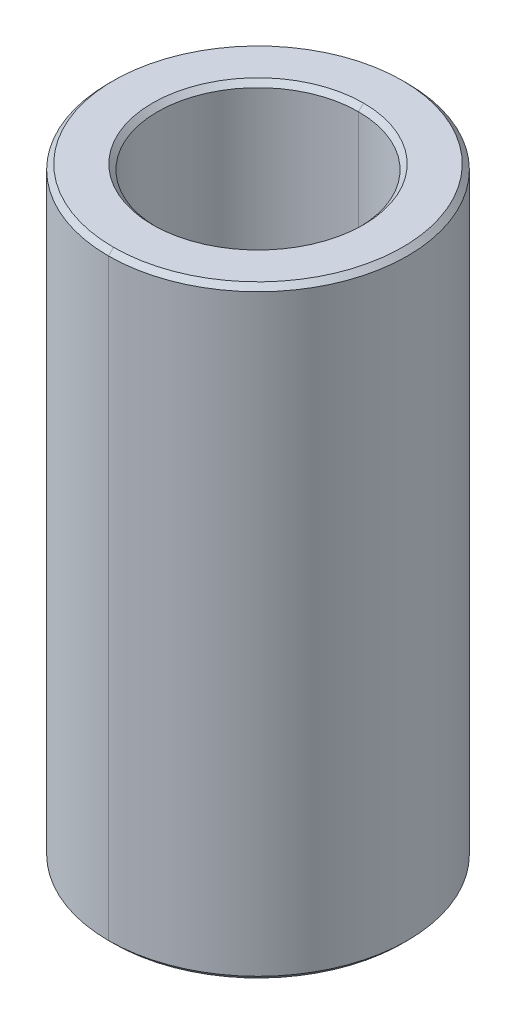
ISO-10303-21;
HEADER;
FILE_DESCRIPTION(('STEP AP214'),'2;1');
FILE_NAME('part.step','',(''),(''),'','','');
FILE_SCHEMA(('AUTOMOTIVE_DESIGN { 1 0 10303 214 1 1 1 1 }'));
ENDSEC;
DATA;
#1=APPLICATION_CONTEXT('core data for automotive mechanical design processes');
#2=APPLICATION_PROTOCOL_DEFINITION('international standard','automotive_design',2000,#1);
#3=PRODUCT_CONTEXT('',#1,'mechanical');
#4=PRODUCT('Part','Part','',(#3));
#5=PRODUCT_RELATED_PRODUCT_CATEGORY('part','',(#4));
#6=PRODUCT_DEFINITION_FORMATION('','',#4);
#7=PRODUCT_DEFINITION_CONTEXT('part definition',#1,'design');
#8=PRODUCT_DEFINITION('design','',#6,#7);
#9=PRODUCT_DEFINITION_SHAPE('','',#8);
#10=(LENGTH_UNIT() NAMED_UNIT(*) SI_UNIT(.MILLI.,.METRE.));
#11=(NAMED_UNIT(*) PLANE_ANGLE_UNIT() SI_UNIT($,.RADIAN.));
#12=(NAMED_UNIT(*) SI_UNIT($,.STERADIAN.) SOLID_ANGLE_UNIT());
#13=UNCERTAINTY_MEASURE_WITH_UNIT(LENGTH_MEASURE(1.E-05),#10,'distance_accuracy_value','');
#14=(GEOMETRIC_REPRESENTATION_CONTEXT(3) GLOBAL_UNCERTAINTY_ASSIGNED_CONTEXT((#13)) GLOBAL_UNIT_ASSIGNED_CONTEXT((#10,
#11,#12)) REPRESENTATION_CONTEXT('',''));
#15=CARTESIAN_POINT('',(0.,0.,0.));
#16=DIRECTION('',(0.,0.,1.));
#17=DIRECTION('',(1.,0.,0.));
#18=AXIS2_PLACEMENT_3D('',#15,#16,#17);
#19=CARTESIAN_POINT('',(0.,5.9,0.));
#20=DIRECTION('',(0.,1.,0.));
#21=DIRECTION('',(0.,0.,1.));
#22=AXIS2_PLACEMENT_3D('',#19,#20,#21);
#23=CONICAL_SURFACE('',#22,2.,0.785398163397457);
#24=DIRECTION('',(0.,0.707106781186542,-0.707106781186554));
#25=VECTOR('',#24,1.);
#26=CARTESIAN_POINT('',(0.,5.9,-2.));
#27=LINE('',#26,#25);
#28=CARTESIAN_POINT('',(0.,5.9,-2.));
#29=VERTEX_POINT('',#28);
#30=CARTESIAN_POINT('',(0.,6.,-2.1));
#31=VERTEX_POINT('',#30);
#32=EDGE_CURVE('E130',#29,#31,#27,.T.);
#33=ORIENTED_EDGE('',*,*,#32,.F.);
#34=CARTESIAN_POINT('',(0.,5.9,0.));
#35=DIRECTION('',(0.,1.,0.));
#36=DIRECTION('',(0.,0.,1.));
#37=AXIS2_PLACEMENT_3D('',#34,#35,#36);
#38=CIRCLE('',#37,2.);
#39=CARTESIAN_POINT('',(0.,5.9,2.));
#40=VERTEX_POINT('',#39);
#41=EDGE_CURVE('E25',#40,#29,#38,.T.);
#42=ORIENTED_EDGE('',*,*,#41,.F.);
#43=DIRECTION('',(0.,0.707106781186542,0.707106781186554));
#44=VECTOR('',#43,1.);
#45=CARTESIAN_POINT('',(0.,5.9,2.));
#46=LINE('',#45,#44);
#47=CARTESIAN_POINT('',(0.,6.,2.1));
#48=VERTEX_POINT('',#47);
#49=EDGE_CURVE('E139',#40,#48,#46,.T.);
#50=ORIENTED_EDGE('',*,*,#49,.T.);
#51=CARTESIAN_POINT('',(0.,6.,0.));
#52=DIRECTION('',(0.,-1.,0.));
#53=DIRECTION('',(0.,0.,1.));
#54=AXIS2_PLACEMENT_3D('',#51,#52,#53);
#55=CIRCLE('',#54,2.1);
#56=EDGE_CURVE('E131',#31,#48,#55,.T.);
#57=ORIENTED_EDGE('',*,*,#56,.F.);
#58=EDGE_LOOP('',(#33,#42,#50,#57));
#59=FACE_BOUND('',#58,.T.);
#60=ADVANCED_FACE('F14',(#59),#23,.F.);
#61=CARTESIAN_POINT('',(0.,-6.,0.));
#62=DIRECTION('',(0.,-1.,0.));
#63=DIRECTION('',(0.,0.,-1.));
#64=AXIS2_PLACEMENT_3D('',#61,#62,#63);
#65=CONICAL_SURFACE('',#64,2.1,0.785398163397448);
#66=DIRECTION('',(0.,-0.707106781186548,0.707106781186548));
#67=VECTOR('',#66,1.);
#68=CARTESIAN_POINT('',(0.,-6.,2.1));
#69=LINE('',#68,#67);
#70=CARTESIAN_POINT('',(0.,-5.9,2.));
#71=VERTEX_POINT('',#70);
#72=CARTESIAN_POINT('',(0.,-6.,2.1));
#73=VERTEX_POINT('',#72);
#74=EDGE_CURVE('E177',#71,#73,#69,.T.);
#75=ORIENTED_EDGE('',*,*,#74,.F.);
#76=CARTESIAN_POINT('',(0.,-5.9,0.));
#77=DIRECTION('',(0.,-1.,0.));
#78=DIRECTION('',(0.,0.,1.));
#79=AXIS2_PLACEMENT_3D('',#76,#77,#78);
#80=CIRCLE('',#79,2.);
#81=CARTESIAN_POINT('',(0.,-5.9,-2.));
#82=VERTEX_POINT('',#81);
#83=EDGE_CURVE('E9',#82,#71,#80,.T.);
#84=ORIENTED_EDGE('',*,*,#83,.F.);
#85=DIRECTION('',(0.,-0.707106781186548,-0.707106781186548));
#86=VECTOR('',#85,1.);
#87=CARTESIAN_POINT('',(0.,-6.,-2.1));
#88=LINE('',#87,#86);
#89=CARTESIAN_POINT('',(0.,-6.,-2.1));
#90=VERTEX_POINT('',#89);
#91=EDGE_CURVE('E212',#82,#90,#88,.T.);
#92=ORIENTED_EDGE('',*,*,#91,.T.);
#93=CARTESIAN_POINT('',(0.,-6.,0.));
#94=DIRECTION('',(0.,1.,0.));
#95=DIRECTION('',(0.,0.,1.));
#96=AXIS2_PLACEMENT_3D('',#93,#94,#95);
#97=CIRCLE('',#96,2.1);
#98=EDGE_CURVE('E69',#73,#90,#97,.T.);
#99=ORIENTED_EDGE('',*,*,#98,.F.);
#100=EDGE_LOOP('',(#75,#84,#92,#99));
#101=FACE_BOUND('',#100,.T.);
#102=ADVANCED_FACE('F253',(#101),#65,.F.);
#103=CARTESIAN_POINT('',(0.,6.,0.));
#104=DIRECTION('',(0.,-1.,0.));
#105=DIRECTION('',(0.,0.,-1.));
#106=AXIS2_PLACEMENT_3D('',#103,#104,#105);
#107=CONICAL_SURFACE('',#106,2.875,0.785398163397443);
#108=DIRECTION('',(0.,-0.707106781186551,0.707106781186545));
#109=VECTOR('',#108,1.);
#110=CARTESIAN_POINT('',(0.,6.,2.875));
#111=LINE('',#110,#109);
#112=CARTESIAN_POINT('',(0.,6.,2.875));
#113=VERTEX_POINT('',#112);
#114=CARTESIAN_POINT('',(0.,5.9,2.975));
#115=VERTEX_POINT('',#114);
#116=EDGE_CURVE('E178',#113,#115,#111,.T.);
#117=ORIENTED_EDGE('',*,*,#116,.F.);
#118=CARTESIAN_POINT('',(0.,6.,0.));
#119=DIRECTION('',(0.,1.,0.));
#120=DIRECTION('',(0.,0.,1.));
#121=AXIS2_PLACEMENT_3D('',#118,#119,#120);
#122=CIRCLE('',#121,2.875);
#123=CARTESIAN_POINT('',(0.,6.,-2.875));
#124=VERTEX_POINT('',#123);
#125=EDGE_CURVE('E164',#124,#113,#122,.T.);
#126=ORIENTED_EDGE('',*,*,#125,.F.);
#127=DIRECTION('',(0.,-0.707106781186551,-0.707106781186545));
#128=VECTOR('',#127,1.);
#129=CARTESIAN_POINT('',(0.,6.,-2.875));
#130=LINE('',#129,#128);
#131=CARTESIAN_POINT('',(0.,5.9,-2.975));
#132=VERTEX_POINT('',#131);
#133=EDGE_CURVE('E159',#124,#132,#130,.T.);
#134=ORIENTED_EDGE('',*,*,#133,.T.);
#135=CARTESIAN_POINT('',(0.,5.9,0.));
#136=DIRECTION('',(0.,-1.,0.));
#137=DIRECTION('',(0.,0.,1.));
#138=AXIS2_PLACEMENT_3D('',#135,#136,#137);
#139=CIRCLE('',#138,2.975);
#140=EDGE_CURVE('E151',#115,#132,#139,.T.);
#141=ORIENTED_EDGE('',*,*,#140,.F.);
#142=EDGE_LOOP('',(#117,#126,#134,#141));
#143=FACE_BOUND('',#142,.T.);
#144=ADVANCED_FACE('F236',(#143),#107,.T.);
#145=CARTESIAN_POINT('',(0.,-5.9,0.));
#146=DIRECTION('',(0.,1.,0.));
#147=DIRECTION('',(0.,0.,1.));
#148=AXIS2_PLACEMENT_3D('',#145,#146,#147);
#149=CONICAL_SURFACE('',#148,2.975,0.785398163397443);
#150=DIRECTION('',(0.,0.707106781186551,-0.707106781186545));
#151=VECTOR('',#150,1.);
#152=CARTESIAN_POINT('',(0.,-5.9,-2.975));
#153=LINE('',#152,#151);
#154=CARTESIAN_POINT('',(0.,-6.,-2.875));
#155=VERTEX_POINT('',#154);
#156=CARTESIAN_POINT('',(0.,-5.9,-2.975));
#157=VERTEX_POINT('',#156);
#158=EDGE_CURVE('E158',#155,#157,#153,.T.);
#159=ORIENTED_EDGE('',*,*,#158,.F.);
#160=CARTESIAN_POINT('',(0.,-6.,0.));
#161=DIRECTION('',(0.,-1.,0.));
#162=DIRECTION('',(0.,0.,1.));
#163=AXIS2_PLACEMENT_3D('',#160,#161,#162);
#164=CIRCLE('',#163,2.875);
#165=CARTESIAN_POINT('',(0.,-6.,2.875));
#166=VERTEX_POINT('',#165);
#167=EDGE_CURVE('E184',#166,#155,#164,.T.);
#168=ORIENTED_EDGE('',*,*,#167,.F.);
#169=DIRECTION('',(0.,0.707106781186551,0.707106781186545));
#170=VECTOR('',#169,1.);
#171=CARTESIAN_POINT('',(0.,-5.9,2.975));
#172=LINE('',#171,#170);
#173=CARTESIAN_POINT('',(0.,-5.9,2.975));
#174=VERTEX_POINT('',#173);
#175=EDGE_CURVE('E192',#166,#174,#172,.T.);
#176=ORIENTED_EDGE('',*,*,#175,.T.);
#177=CARTESIAN_POINT('',(0.,-5.9,0.));
#178=DIRECTION('',(0.,1.,0.));
#179=DIRECTION('',(0.,0.,1.));
#180=AXIS2_PLACEMENT_3D('',#177,#178,#179);
#181=CIRCLE('',#180,2.975);
#182=EDGE_CURVE('E40',#157,#174,#181,.T.);
#183=ORIENTED_EDGE('',*,*,#182,.F.);
#184=EDGE_LOOP('',(#159,#168,#176,#183));
#185=FACE_BOUND('',#184,.T.);
#186=ADVANCED_FACE('F270',(#185),#149,.T.);
#187=CARTESIAN_POINT('',(0.,6.,0.));
#188=DIRECTION('',(0.,-1.,0.));
#189=DIRECTION('',(0.,0.,-1.));
#190=AXIS2_PLACEMENT_3D('',#187,#188,#189);
#191=CYLINDRICAL_SURFACE('',#190,2.);
#192=DIRECTION('',(0.,-1.,0.));
#193=VECTOR('',#192,1.);
#194=CARTESIAN_POINT('',(0.,6.,2.));
#195=LINE('',#194,#193);
#196=EDGE_CURVE('E112',#40,#71,#195,.T.);
#197=ORIENTED_EDGE('',*,*,#196,.F.);
#198=ORIENTED_EDGE('',*,*,#41,.T.);
#199=DIRECTION('',(0.,-1.,0.));
#200=VECTOR('',#199,1.);
#201=CARTESIAN_POINT('',(0.,6.,-2.));
#202=LINE('',#201,#200);
#203=EDGE_CURVE('E109',#29,#82,#202,.T.);
#204=ORIENTED_EDGE('',*,*,#203,.T.);
#205=ORIENTED_EDGE('',*,*,#83,.T.);
#206=EDGE_LOOP('',(#197,#198,#204,#205));
#207=FACE_BOUND('',#206,.T.);
#208=ADVANCED_FACE('F108',(#207),#191,.F.);
#209=CARTESIAN_POINT('',(0.,6.,0.));
#210=DIRECTION('',(0.,-1.,0.));
#211=DIRECTION('',(0.,0.,-1.));
#212=AXIS2_PLACEMENT_3D('',#209,#210,#211);
#213=CYLINDRICAL_SURFACE('',#212,2.975);
#214=DIRECTION('',(0.,-1.,0.));
#215=VECTOR('',#214,1.);
#216=CARTESIAN_POINT('',(0.,6.,2.975));
#217=LINE('',#216,#215);
#218=EDGE_CURVE('E128',#115,#174,#217,.T.);
#219=ORIENTED_EDGE('',*,*,#218,.F.);
#220=ORIENTED_EDGE('',*,*,#140,.T.);
#221=DIRECTION('',(0.,-1.,0.));
#222=VECTOR('',#221,1.);
#223=CARTESIAN_POINT('',(0.,6.,-2.975));
#224=LINE('',#223,#222);
#225=EDGE_CURVE('E150',#132,#157,#224,.T.);
#226=ORIENTED_EDGE('',*,*,#225,.T.);
#227=ORIENTED_EDGE('',*,*,#182,.T.);
#228=EDGE_LOOP('',(#219,#220,#226,#227));
#229=FACE_BOUND('',#228,.T.);
#230=ADVANCED_FACE('F237',(#229),#213,.T.);
#231=CARTESIAN_POINT('',(0.,-6.,0.));
#232=DIRECTION('',(0.,1.,0.));
#233=DIRECTION('',(1.,0.,0.));
#234=AXIS2_PLACEMENT_3D('',#231,#232,#233);
#235=PLANE('',#234);
#236=CARTESIAN_POINT('',(0.,-6.,0.));
#237=DIRECTION('',(0.,1.,0.));
#238=DIRECTION('',(0.,0.,1.));
#239=AXIS2_PLACEMENT_3D('',#236,#237,#238);
#240=CIRCLE('',#239,2.1);
#241=EDGE_CURVE('E210',#90,#73,#240,.T.);
#242=ORIENTED_EDGE('',*,*,#241,.T.);
#243=ORIENTED_EDGE('',*,*,#98,.T.);
#244=EDGE_LOOP('',(#242,#243));
#245=FACE_BOUND('',#244,.T.);
#246=ORIENTED_EDGE('',*,*,#167,.T.);
#247=CARTESIAN_POINT('',(0.,-6.,0.));
#248=DIRECTION('',(0.,-1.,0.));
#249=DIRECTION('',(0.,0.,1.));
#250=AXIS2_PLACEMENT_3D('',#247,#248,#249);
#251=CIRCLE('',#250,2.875);
#252=EDGE_CURVE('E154',#155,#166,#251,.T.);
#253=ORIENTED_EDGE('',*,*,#252,.T.);
#254=EDGE_LOOP('',(#246,#253));
#255=FACE_BOUND('',#254,.T.);
#256=ADVANCED_FACE('F16',(#245,#255),#235,.F.);
#257=CARTESIAN_POINT('',(0.,6.,0.));
#258=DIRECTION('',(0.,1.,0.));
#259=DIRECTION('',(1.,0.,0.));
#260=AXIS2_PLACEMENT_3D('',#257,#258,#259);
#261=PLANE('',#260);
#262=CARTESIAN_POINT('',(0.,6.,0.));
#263=DIRECTION('',(0.,-1.,0.));
#264=DIRECTION('',(0.,0.,1.));
#265=AXIS2_PLACEMENT_3D('',#262,#263,#264);
#266=CIRCLE('',#265,2.1);
#267=EDGE_CURVE('E136',#48,#31,#266,.T.);
#268=ORIENTED_EDGE('',*,*,#267,.T.);
#269=ORIENTED_EDGE('',*,*,#56,.T.);
#270=EDGE_LOOP('',(#268,#269));
#271=FACE_BOUND('',#270,.T.);
#272=ORIENTED_EDGE('',*,*,#125,.T.);
#273=CARTESIAN_POINT('',(0.,6.,0.));
#274=DIRECTION('',(0.,1.,0.));
#275=DIRECTION('',(0.,0.,1.));
#276=AXIS2_PLACEMENT_3D('',#273,#274,#275);
#277=CIRCLE('',#276,2.875);
#278=EDGE_CURVE('E18',#113,#124,#277,.T.);
#279=ORIENTED_EDGE('',*,*,#278,.T.);
#280=EDGE_LOOP('',(#272,#279));
#281=FACE_BOUND('',#280,.T.);
#282=ADVANCED_FACE('F227',(#271,#281),#261,.T.);
#283=CARTESIAN_POINT('',(0.,6.,0.));
#284=DIRECTION('',(0.,-1.,0.));
#285=DIRECTION('',(0.,0.,-1.));
#286=AXIS2_PLACEMENT_3D('',#283,#284,#285);
#287=CYLINDRICAL_SURFACE('',#286,2.975);
#288=CARTESIAN_POINT('',(0.,5.9,0.));
#289=DIRECTION('',(0.,-1.,0.));
#290=DIRECTION('',(0.,0.,1.));
#291=AXIS2_PLACEMENT_3D('',#288,#289,#290);
#292=CIRCLE('',#291,2.975);
#293=EDGE_CURVE('E172',#132,#115,#292,.T.);
#294=ORIENTED_EDGE('',*,*,#293,.T.);
#295=ORIENTED_EDGE('',*,*,#218,.T.);
#296=CARTESIAN_POINT('',(0.,-5.9,0.));
#297=DIRECTION('',(0.,1.,0.));
#298=DIRECTION('',(0.,0.,1.));
#299=AXIS2_PLACEMENT_3D('',#296,#297,#298);
#300=CIRCLE('',#299,2.975);
#301=EDGE_CURVE('E163',#174,#157,#300,.T.);
#302=ORIENTED_EDGE('',*,*,#301,.T.);
#303=ORIENTED_EDGE('',*,*,#225,.F.);
#304=EDGE_LOOP('',(#294,#295,#302,#303));
#305=FACE_BOUND('',#304,.T.);
#306=ADVANCED_FACE('F238',(#305),#287,.T.);
#307=CARTESIAN_POINT('',(0.,6.,0.));
#308=DIRECTION('',(0.,-1.,0.));
#309=DIRECTION('',(0.,0.,-1.));
#310=AXIS2_PLACEMENT_3D('',#307,#308,#309);
#311=CYLINDRICAL_SURFACE('',#310,2.);
#312=CARTESIAN_POINT('',(0.,5.9,0.));
#313=DIRECTION('',(0.,1.,0.));
#314=DIRECTION('',(0.,0.,1.));
#315=AXIS2_PLACEMENT_3D('',#312,#313,#314);
#316=CIRCLE('',#315,2.);
#317=EDGE_CURVE('E124',#29,#40,#316,.T.);
#318=ORIENTED_EDGE('',*,*,#317,.T.);
#319=ORIENTED_EDGE('',*,*,#196,.T.);
#320=CARTESIAN_POINT('',(0.,-5.9,0.));
#321=DIRECTION('',(0.,-1.,0.));
#322=DIRECTION('',(0.,0.,1.));
#323=AXIS2_PLACEMENT_3D('',#320,#321,#322);
#324=CIRCLE('',#323,2.);
#325=EDGE_CURVE('E126',#71,#82,#324,.T.);
#326=ORIENTED_EDGE('',*,*,#325,.T.);
#327=ORIENTED_EDGE('',*,*,#203,.F.);
#328=EDGE_LOOP('',(#318,#319,#326,#327));
#329=FACE_BOUND('',#328,.T.);
#330=ADVANCED_FACE('F122',(#329),#311,.F.);
#331=CARTESIAN_POINT('',(0.,-5.9,0.));
#332=DIRECTION('',(0.,1.,0.));
#333=DIRECTION('',(0.,0.,1.));
#334=AXIS2_PLACEMENT_3D('',#331,#332,#333);
#335=CONICAL_SURFACE('',#334,2.975,0.785398163397443);
#336=ORIENTED_EDGE('',*,*,#252,.F.);
#337=ORIENTED_EDGE('',*,*,#158,.T.);
#338=ORIENTED_EDGE('',*,*,#301,.F.);
#339=ORIENTED_EDGE('',*,*,#175,.F.);
#340=EDGE_LOOP('',(#336,#337,#338,#339));
#341=FACE_BOUND('',#340,.T.);
#342=ADVANCED_FACE('F246',(#341),#335,.T.);
#343=CARTESIAN_POINT('',(0.,6.,0.));
#344=DIRECTION('',(0.,-1.,0.));
#345=DIRECTION('',(0.,0.,-1.));
#346=AXIS2_PLACEMENT_3D('',#343,#344,#345);
#347=CONICAL_SURFACE('',#346,2.875,0.785398163397443);
#348=ORIENTED_EDGE('',*,*,#278,.F.);
#349=ORIENTED_EDGE('',*,*,#116,.T.);
#350=ORIENTED_EDGE('',*,*,#293,.F.);
#351=ORIENTED_EDGE('',*,*,#133,.F.);
#352=EDGE_LOOP('',(#348,#349,#350,#351));
#353=FACE_BOUND('',#352,.T.);
#354=ADVANCED_FACE('F232',(#353),#347,.T.);
#355=CARTESIAN_POINT('',(0.,-6.,0.));
#356=DIRECTION('',(0.,-1.,0.));
#357=DIRECTION('',(0.,0.,-1.));
#358=AXIS2_PLACEMENT_3D('',#355,#356,#357);
#359=CONICAL_SURFACE('',#358,2.1,0.785398163397448);
#360=ORIENTED_EDGE('',*,*,#325,.F.);
#361=ORIENTED_EDGE('',*,*,#74,.T.);
#362=ORIENTED_EDGE('',*,*,#241,.F.);
#363=ORIENTED_EDGE('',*,*,#91,.F.);
#364=EDGE_LOOP('',(#360,#361,#362,#363));
#365=FACE_BOUND('',#364,.T.);
#366=ADVANCED_FACE('F259',(#365),#359,.F.);
#367=CARTESIAN_POINT('',(0.,5.9,0.));
#368=DIRECTION('',(0.,1.,0.));
#369=DIRECTION('',(0.,0.,1.));
#370=AXIS2_PLACEMENT_3D('',#367,#368,#369);
#371=CONICAL_SURFACE('',#370,2.,0.785398163397457);
#372=ORIENTED_EDGE('',*,*,#317,.F.);
#373=ORIENTED_EDGE('',*,*,#32,.T.);
#374=ORIENTED_EDGE('',*,*,#267,.F.);
#375=ORIENTED_EDGE('',*,*,#49,.F.);
#376=EDGE_LOOP('',(#372,#373,#374,#375));
#377=FACE_BOUND('',#376,.T.);
#378=ADVANCED_FACE('F138',(#377),#371,.F.);
#379=CLOSED_SHELL('',(#60,#102,#144,#186,#208,#230,#256,#282,#306,#330,#342,#354,#366,#378));
#380=MANIFOLD_SOLID_BREP('B1',#379);
#381=ADVANCED_BREP_SHAPE_REPRESENTATION('',(#18,#380),#14);
#382=SHAPE_DEFINITION_REPRESENTATION(#9,#381);
ENDSEC;
END-ISO-10303-21;
